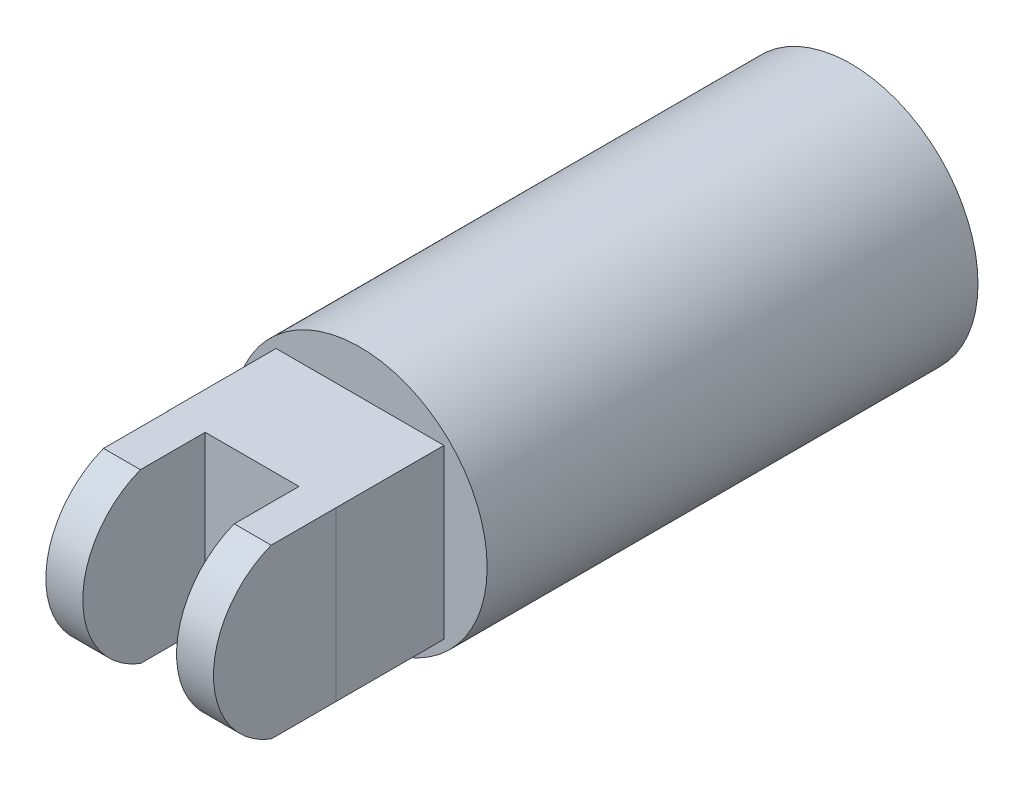
ISO-10303-21;
HEADER;
FILE_DESCRIPTION(('STEP AP214'),'2;1');
FILE_NAME('part.step','',(''),(''),'','','');
FILE_SCHEMA(('AUTOMOTIVE_DESIGN { 1 0 10303 214 1 1 1 1 }'));
ENDSEC;
DATA;
#1=APPLICATION_CONTEXT('core data for automotive mechanical design processes');
#2=APPLICATION_PROTOCOL_DEFINITION('international standard','automotive_design',2000,#1);
#3=PRODUCT_CONTEXT('',#1,'mechanical');
#4=PRODUCT('Part','Part','',(#3));
#5=PRODUCT_RELATED_PRODUCT_CATEGORY('part','',(#4));
#6=PRODUCT_DEFINITION_FORMATION('','',#4);
#7=PRODUCT_DEFINITION_CONTEXT('part definition',#1,'design');
#8=PRODUCT_DEFINITION('design','',#6,#7);
#9=PRODUCT_DEFINITION_SHAPE('','',#8);
#10=(LENGTH_UNIT() NAMED_UNIT(*) SI_UNIT(.MILLI.,.METRE.));
#11=(NAMED_UNIT(*) PLANE_ANGLE_UNIT() SI_UNIT($,.RADIAN.));
#12=(NAMED_UNIT(*) SI_UNIT($,.STERADIAN.) SOLID_ANGLE_UNIT());
#13=UNCERTAINTY_MEASURE_WITH_UNIT(LENGTH_MEASURE(1.E-05),#10,'distance_accuracy_value','');
#14=(GEOMETRIC_REPRESENTATION_CONTEXT(3) GLOBAL_UNCERTAINTY_ASSIGNED_CONTEXT((#13)) GLOBAL_UNIT_ASSIGNED_CONTEXT((#10,
#11,#12)) REPRESENTATION_CONTEXT('',''));
#15=CARTESIAN_POINT('',(0.,0.,0.));
#16=DIRECTION('',(0.,0.,1.));
#17=DIRECTION('',(1.,0.,0.));
#18=AXIS2_PLACEMENT_3D('',#15,#16,#17);
#19=CARTESIAN_POINT('',(0.,0.,30.5));
#20=DIRECTION('',(0.,0.,1.));
#21=DIRECTION('',(1.,0.,0.));
#22=AXIS2_PLACEMENT_3D('',#19,#20,#21);
#23=PLANE('',#22);
#24=DIRECTION('',(1.,0.,0.));
#25=VECTOR('',#24,1.);
#26=CARTESIAN_POINT('',(4.275,-4.275,30.5));
#27=LINE('',#26,#25);
#28=CARTESIAN_POINT('',(-2.38289149753268,-4.275,30.5));
#29=VERTEX_POINT('',#28);
#30=CARTESIAN_POINT('',(2.39501883876455,-4.275,30.5));
#31=VERTEX_POINT('',#30);
#32=EDGE_CURVE('E55',#29,#31,#27,.T.);
#33=ORIENTED_EDGE('',*,*,#32,.T.);
#34=DIRECTION('',(0.,-1.,0.));
#35=VECTOR('',#34,1.);
#36=CARTESIAN_POINT('',(2.39501883876455,-4.275,30.5));
#37=LINE('',#36,#35);
#38=CARTESIAN_POINT('',(2.39501883876455,4.275,30.5));
#39=VERTEX_POINT('',#38);
#40=EDGE_CURVE('E162',#39,#31,#37,.T.);
#41=ORIENTED_EDGE('',*,*,#40,.F.);
#42=DIRECTION('',(-1.,0.,0.));
#43=VECTOR('',#42,1.);
#44=CARTESIAN_POINT('',(4.275,4.275,30.5));
#45=LINE('',#44,#43);
#46=CARTESIAN_POINT('',(-2.38289149753268,4.275,30.5));
#47=VERTEX_POINT('',#46);
#48=EDGE_CURVE('E211',#39,#47,#45,.T.);
#49=ORIENTED_EDGE('',*,*,#48,.T.);
#50=DIRECTION('',(0.,1.,0.));
#51=VECTOR('',#50,1.);
#52=CARTESIAN_POINT('',(-2.38289149753268,-4.275,30.5));
#53=LINE('',#52,#51);
#54=EDGE_CURVE('E149',#29,#47,#53,.T.);
#55=ORIENTED_EDGE('',*,*,#54,.F.);
#56=EDGE_LOOP('',(#33,#41,#49,#55));
#57=FACE_BOUND('',#56,.T.);
#58=ADVANCED_FACE('F40',(#57),#23,.T.);
#59=DIRECTION('',(0.,-1.,0.));
#60=VECTOR('',#59,1.);
#61=CARTESIAN_POINT('',(-4.26289149753268,-4.275,30.5));
#62=LINE('',#61,#60);
#63=CARTESIAN_POINT('',(-4.26289149753268,4.275,30.5));
#64=VERTEX_POINT('',#63);
#65=CARTESIAN_POINT('',(-4.26289149753268,-4.275,30.5));
#66=VERTEX_POINT('',#65);
#67=EDGE_CURVE('E63',#64,#66,#62,.T.);
#68=ORIENTED_EDGE('',*,*,#67,.F.);
#69=CARTESIAN_POINT('',(-4.275,4.275,30.5));
#70=VERTEX_POINT('',#69);
#71=EDGE_CURVE('E210',#64,#70,#45,.T.);
#72=ORIENTED_EDGE('',*,*,#71,.T.);
#73=DIRECTION('',(0.,-1.,0.));
#74=VECTOR('',#73,1.);
#75=CARTESIAN_POINT('',(-4.275,-4.275,30.5));
#76=LINE('',#75,#74);
#77=CARTESIAN_POINT('',(-4.275,-4.275,30.5));
#78=VERTEX_POINT('',#77);
#79=EDGE_CURVE('E201',#70,#78,#76,.T.);
#80=ORIENTED_EDGE('',*,*,#79,.T.);
#81=EDGE_CURVE('E205',#78,#66,#27,.T.);
#82=ORIENTED_EDGE('',*,*,#81,.T.);
#83=EDGE_LOOP('',(#68,#72,#80,#82));
#84=FACE_BOUND('',#83,.T.);
#85=ADVANCED_FACE('F251',(#84),#23,.T.);
#86=CARTESIAN_POINT('',(0.,0.,25.));
#87=DIRECTION('',(0.,0.,-1.));
#88=DIRECTION('',(-1.,0.,0.));
#89=AXIS2_PLACEMENT_3D('',#86,#87,#88);
#90=CYLINDRICAL_SURFACE('',#89,6.475);
#91=CARTESIAN_POINT('',(0.,0.,25.));
#92=DIRECTION('',(0.,0.,1.));
#93=DIRECTION('',(1.,0.,0.));
#94=AXIS2_PLACEMENT_3D('',#91,#92,#93);
#95=CIRCLE('',#94,6.475);
#96=CARTESIAN_POINT('',(6.475,0.,25.));
#97=VERTEX_POINT('',#96);
#98=EDGE_CURVE('E11',#97,#97,#95,.T.);
#99=ORIENTED_EDGE('',*,*,#98,.F.);
#100=EDGE_LOOP('',(#99));
#101=FACE_BOUND('',#100,.T.);
#102=CARTESIAN_POINT('',(0.,0.,0.));
#103=DIRECTION('',(0.,0.,1.));
#104=DIRECTION('',(1.,0.,0.));
#105=AXIS2_PLACEMENT_3D('',#102,#103,#104);
#106=CIRCLE('',#105,6.475);
#107=CARTESIAN_POINT('',(6.475,0.,0.));
#108=VERTEX_POINT('',#107);
#109=EDGE_CURVE('E44',#108,#108,#106,.T.);
#110=ORIENTED_EDGE('',*,*,#109,.T.);
#111=EDGE_LOOP('',(#110));
#112=FACE_BOUND('',#111,.T.);
#113=ADVANCED_FACE('F42',(#101,#112),#90,.T.);
#114=CARTESIAN_POINT('',(0.,0.,25.));
#115=DIRECTION('',(0.,0.,1.));
#116=DIRECTION('',(1.,0.,0.));
#117=AXIS2_PLACEMENT_3D('',#114,#115,#116);
#118=PLANE('',#117);
#119=DIRECTION('',(0.,-1.,0.));
#120=VECTOR('',#119,1.);
#121=CARTESIAN_POINT('',(-4.275,-4.275,25.));
#122=LINE('',#121,#120);
#123=CARTESIAN_POINT('',(-4.275,4.275,25.));
#124=VERTEX_POINT('',#123);
#125=CARTESIAN_POINT('',(-4.275,-4.275,25.));
#126=VERTEX_POINT('',#125);
#127=EDGE_CURVE('E137',#124,#126,#122,.T.);
#128=ORIENTED_EDGE('',*,*,#127,.F.);
#129=DIRECTION('',(-1.,0.,0.));
#130=VECTOR('',#129,1.);
#131=CARTESIAN_POINT('',(4.275,4.275,25.));
#132=LINE('',#131,#130);
#133=CARTESIAN_POINT('',(4.275,4.275,25.));
#134=VERTEX_POINT('',#133);
#135=EDGE_CURVE('E204',#134,#124,#132,.T.);
#136=ORIENTED_EDGE('',*,*,#135,.F.);
#137=DIRECTION('',(0.,1.,0.));
#138=VECTOR('',#137,1.);
#139=CARTESIAN_POINT('',(4.275,-4.275,25.));
#140=LINE('',#139,#138);
#141=CARTESIAN_POINT('',(4.275,-4.275,25.));
#142=VERTEX_POINT('',#141);
#143=EDGE_CURVE('E218',#142,#134,#140,.T.);
#144=ORIENTED_EDGE('',*,*,#143,.F.);
#145=DIRECTION('',(1.,0.,0.));
#146=VECTOR('',#145,1.);
#147=CARTESIAN_POINT('',(4.275,-4.275,25.));
#148=LINE('',#147,#146);
#149=EDGE_CURVE('E216',#126,#142,#148,.T.);
#150=ORIENTED_EDGE('',*,*,#149,.F.);
#151=EDGE_LOOP('',(#128,#136,#144,#150));
#152=FACE_BOUND('',#151,.T.);
#153=ORIENTED_EDGE('',*,*,#98,.T.);
#154=EDGE_LOOP('',(#153));
#155=FACE_BOUND('',#154,.T.);
#156=ADVANCED_FACE('F241',(#152,#155),#118,.T.);
#157=CARTESIAN_POINT('',(0.,0.,0.));
#158=DIRECTION('',(0.,0.,1.));
#159=DIRECTION('',(1.,0.,0.));
#160=AXIS2_PLACEMENT_3D('',#157,#158,#159);
#161=PLANE('',#160);
#162=ORIENTED_EDGE('',*,*,#109,.F.);
#163=EDGE_LOOP('',(#162));
#164=FACE_BOUND('',#163,.T.);
#165=ADVANCED_FACE('F238',(#164),#161,.F.);
#166=CARTESIAN_POINT('',(-4.275,-4.275,30.5));
#167=DIRECTION('',(1.,0.,0.));
#168=DIRECTION('',(0.,0.,-1.));
#169=AXIS2_PLACEMENT_3D('',#166,#167,#168);
#170=PLANE('',#169);
#171=ORIENTED_EDGE('',*,*,#127,.T.);
#172=DIRECTION('',(0.,0.,-1.));
#173=VECTOR('',#172,1.);
#174=CARTESIAN_POINT('',(-4.275,-4.275,30.5));
#175=LINE('',#174,#173);
#176=EDGE_CURVE('E231',#78,#126,#175,.T.);
#177=ORIENTED_EDGE('',*,*,#176,.F.);
#178=ORIENTED_EDGE('',*,*,#79,.F.);
#179=DIRECTION('',(0.,0.,-1.));
#180=VECTOR('',#179,1.);
#181=CARTESIAN_POINT('',(-4.275,4.275,30.5));
#182=LINE('',#181,#180);
#183=EDGE_CURVE('E213',#70,#124,#182,.T.);
#184=ORIENTED_EDGE('',*,*,#183,.T.);
#185=EDGE_LOOP('',(#171,#177,#178,#184));
#186=FACE_BOUND('',#185,.T.);
#187=ADVANCED_FACE('F240',(#186),#170,.F.);
#188=CARTESIAN_POINT('',(4.275,-4.275,30.5));
#189=DIRECTION('',(0.,1.,0.));
#190=DIRECTION('',(-1.,0.,0.));
#191=AXIS2_PLACEMENT_3D('',#188,#189,#190);
#192=PLANE('',#191);
#193=ORIENTED_EDGE('',*,*,#149,.T.);
#194=DIRECTION('',(0.,0.,-1.));
#195=VECTOR('',#194,1.);
#196=CARTESIAN_POINT('',(4.275,-4.275,30.5));
#197=LINE('',#196,#195);
#198=CARTESIAN_POINT('',(4.275,-4.275,30.5));
#199=VERTEX_POINT('',#198);
#200=EDGE_CURVE('E228',#199,#142,#197,.T.);
#201=ORIENTED_EDGE('',*,*,#200,.F.);
#202=DIRECTION('',(1.,0.,0.));
#203=VECTOR('',#202,1.);
#204=CARTESIAN_POINT('',(4.27501883876455,-4.275,30.5));
#205=LINE('',#204,#203);
#206=CARTESIAN_POINT('',(4.27501883876455,-4.275,30.5));
#207=VERTEX_POINT('',#206);
#208=EDGE_CURVE('E175',#199,#207,#205,.T.);
#209=ORIENTED_EDGE('',*,*,#208,.T.);
#210=DIRECTION('',(0.,0.,-1.));
#211=VECTOR('',#210,1.);
#212=CARTESIAN_POINT('',(4.27501883876455,-4.275,33.8));
#213=LINE('',#212,#211);
#214=CARTESIAN_POINT('',(4.27501883876455,-4.275,33.8));
#215=VERTEX_POINT('',#214);
#216=EDGE_CURVE('E186',#215,#207,#213,.T.);
#217=ORIENTED_EDGE('',*,*,#216,.F.);
#218=DIRECTION('',(1.,0.,0.));
#219=VECTOR('',#218,1.);
#220=CARTESIAN_POINT('',(4.27501883876455,-4.275,33.8));
#221=LINE('',#220,#219);
#222=CARTESIAN_POINT('',(2.39501883876455,-4.275,33.8));
#223=VERTEX_POINT('',#222);
#224=EDGE_CURVE('E165',#223,#215,#221,.T.);
#225=ORIENTED_EDGE('',*,*,#224,.F.);
#226=DIRECTION('',(0.,0.,-1.));
#227=VECTOR('',#226,1.);
#228=CARTESIAN_POINT('',(2.39501883876455,-4.275,33.8));
#229=LINE('',#228,#227);
#230=EDGE_CURVE('E189',#223,#31,#229,.T.);
#231=ORIENTED_EDGE('',*,*,#230,.T.);
#232=ORIENTED_EDGE('',*,*,#32,.F.);
#233=DIRECTION('',(0.,0.,-1.));
#234=VECTOR('',#233,1.);
#235=CARTESIAN_POINT('',(-2.38289149753268,-4.275,33.8));
#236=LINE('',#235,#234);
#237=CARTESIAN_POINT('',(-2.38289149753268,-4.275,33.8));
#238=VERTEX_POINT('',#237);
#239=EDGE_CURVE('E138',#238,#29,#236,.T.);
#240=ORIENTED_EDGE('',*,*,#239,.F.);
#241=DIRECTION('',(1.,0.,0.));
#242=VECTOR('',#241,1.);
#243=CARTESIAN_POINT('',(-2.38289149753268,-4.275,33.8));
#244=LINE('',#243,#242);
#245=CARTESIAN_POINT('',(-4.26289149753268,-4.275,33.8));
#246=VERTEX_POINT('',#245);
#247=EDGE_CURVE('E141',#246,#238,#244,.T.);
#248=ORIENTED_EDGE('',*,*,#247,.F.);
#249=DIRECTION('',(0.,0.,-1.));
#250=VECTOR('',#249,1.);
#251=CARTESIAN_POINT('',(-4.26289149753268,-4.275,33.8));
#252=LINE('',#251,#250);
#253=EDGE_CURVE('E130',#246,#66,#252,.T.);
#254=ORIENTED_EDGE('',*,*,#253,.T.);
#255=ORIENTED_EDGE('',*,*,#81,.F.);
#256=ORIENTED_EDGE('',*,*,#176,.T.);
#257=EDGE_LOOP('',(#193,#201,#209,#217,#225,#231,#232,#240,#248,#254,#255,#256));
#258=FACE_BOUND('',#257,.T.);
#259=ADVANCED_FACE('F143',(#258),#192,.F.);
#260=CARTESIAN_POINT('',(4.275,-4.275,30.5));
#261=DIRECTION('',(-1.,0.,0.));
#262=DIRECTION('',(0.,0.,1.));
#263=AXIS2_PLACEMENT_3D('',#260,#261,#262);
#264=PLANE('',#263);
#265=ORIENTED_EDGE('',*,*,#143,.T.);
#266=DIRECTION('',(0.,0.,-1.));
#267=VECTOR('',#266,1.);
#268=CARTESIAN_POINT('',(4.275,4.275,30.5));
#269=LINE('',#268,#267);
#270=CARTESIAN_POINT('',(4.275,4.275,30.5));
#271=VERTEX_POINT('',#270);
#272=EDGE_CURVE('E225',#271,#134,#269,.T.);
#273=ORIENTED_EDGE('',*,*,#272,.F.);
#274=DIRECTION('',(0.,1.,0.));
#275=VECTOR('',#274,1.);
#276=CARTESIAN_POINT('',(4.275,-4.275,30.5));
#277=LINE('',#276,#275);
#278=EDGE_CURVE('E207',#199,#271,#277,.T.);
#279=ORIENTED_EDGE('',*,*,#278,.F.);
#280=ORIENTED_EDGE('',*,*,#200,.T.);
#281=EDGE_LOOP('',(#265,#273,#279,#280));
#282=FACE_BOUND('',#281,.T.);
#283=ADVANCED_FACE('F262',(#282),#264,.F.);
#284=CARTESIAN_POINT('',(4.275,4.275,30.5));
#285=DIRECTION('',(0.,-1.,0.));
#286=DIRECTION('',(1.,0.,0.));
#287=AXIS2_PLACEMENT_3D('',#284,#285,#286);
#288=PLANE('',#287);
#289=ORIENTED_EDGE('',*,*,#135,.T.);
#290=ORIENTED_EDGE('',*,*,#183,.F.);
#291=ORIENTED_EDGE('',*,*,#71,.F.);
#292=DIRECTION('',(0.,0.,-1.));
#293=VECTOR('',#292,1.);
#294=CARTESIAN_POINT('',(-4.26289149753268,4.275,33.8));
#295=LINE('',#294,#293);
#296=CARTESIAN_POINT('',(-4.26289149753268,4.275,33.8));
#297=VERTEX_POINT('',#296);
#298=EDGE_CURVE('E192',#297,#64,#295,.T.);
#299=ORIENTED_EDGE('',*,*,#298,.F.);
#300=DIRECTION('',(-1.,0.,0.));
#301=VECTOR('',#300,1.);
#302=CARTESIAN_POINT('',(-2.38289149753268,4.275,33.8));
#303=LINE('',#302,#301);
#304=CARTESIAN_POINT('',(-2.38289149753268,4.275,33.8));
#305=VERTEX_POINT('',#304);
#306=EDGE_CURVE('E148',#305,#297,#303,.T.);
#307=ORIENTED_EDGE('',*,*,#306,.F.);
#308=DIRECTION('',(0.,0.,-1.));
#309=VECTOR('',#308,1.);
#310=CARTESIAN_POINT('',(-2.38289149753268,4.275,33.8));
#311=LINE('',#310,#309);
#312=EDGE_CURVE('E197',#305,#47,#311,.T.);
#313=ORIENTED_EDGE('',*,*,#312,.T.);
#314=ORIENTED_EDGE('',*,*,#48,.F.);
#315=DIRECTION('',(0.,0.,-1.));
#316=VECTOR('',#315,1.);
#317=CARTESIAN_POINT('',(2.39501883876455,4.275,33.8));
#318=LINE('',#317,#316);
#319=CARTESIAN_POINT('',(2.39501883876455,4.275,33.8));
#320=VERTEX_POINT('',#319);
#321=EDGE_CURVE('E172',#320,#39,#318,.T.);
#322=ORIENTED_EDGE('',*,*,#321,.F.);
#323=DIRECTION('',(-1.,0.,0.));
#324=VECTOR('',#323,1.);
#325=CARTESIAN_POINT('',(4.27501883876455,4.275,33.8));
#326=LINE('',#325,#324);
#327=CARTESIAN_POINT('',(4.27501883876455,4.275,33.8));
#328=VERTEX_POINT('',#327);
#329=EDGE_CURVE('E168',#328,#320,#326,.T.);
#330=ORIENTED_EDGE('',*,*,#329,.F.);
#331=DIRECTION('',(0.,0.,-1.));
#332=VECTOR('',#331,1.);
#333=CARTESIAN_POINT('',(4.27501883876455,4.275,33.8));
#334=LINE('',#333,#332);
#335=CARTESIAN_POINT('',(4.27501883876455,4.275,30.5));
#336=VERTEX_POINT('',#335);
#337=EDGE_CURVE('E183',#328,#336,#334,.T.);
#338=ORIENTED_EDGE('',*,*,#337,.T.);
#339=DIRECTION('',(-1.,0.,0.));
#340=VECTOR('',#339,1.);
#341=CARTESIAN_POINT('',(4.27501883876455,4.275,30.5));
#342=LINE('',#341,#340);
#343=EDGE_CURVE('E169',#336,#271,#342,.T.);
#344=ORIENTED_EDGE('',*,*,#343,.T.);
#345=ORIENTED_EDGE('',*,*,#272,.T.);
#346=EDGE_LOOP('',(#289,#290,#291,#299,#307,#313,#314,#322,#330,#338,#344,#345));
#347=FACE_BOUND('',#346,.T.);
#348=ADVANCED_FACE('F259',(#347),#288,.F.);
#349=CARTESIAN_POINT('',(-4.26289149753268,-4.275,33.8));
#350=DIRECTION('',(1.,0.,0.));
#351=DIRECTION('',(0.,0.,-1.));
#352=AXIS2_PLACEMENT_3D('',#349,#350,#351);
#353=PLANE('',#352);
#354=ORIENTED_EDGE('',*,*,#67,.T.);
#355=ORIENTED_EDGE('',*,*,#253,.F.);
#356=CARTESIAN_POINT('',(-4.26289149753268,0.,32.1565965194146));
#357=DIRECTION('',(-1.,0.,0.));
#358=DIRECTION('',(0.,0.,-1.));
#359=AXIS2_PLACEMENT_3D('',#356,#357,#358);
#360=CIRCLE('',#359,4.58000000000001);
#361=EDGE_CURVE('E135',#246,#297,#360,.T.);
#362=ORIENTED_EDGE('',*,*,#361,.T.);
#363=ORIENTED_EDGE('',*,*,#298,.T.);
#364=EDGE_LOOP('',(#354,#355,#362,#363));
#365=FACE_BOUND('',#364,.T.);
#366=ADVANCED_FACE('F132',(#365),#353,.F.);
#367=CARTESIAN_POINT('',(-2.38289149753268,-4.275,33.8));
#368=DIRECTION('',(-1.,0.,0.));
#369=DIRECTION('',(0.,0.,1.));
#370=AXIS2_PLACEMENT_3D('',#367,#368,#369);
#371=PLANE('',#370);
#372=ORIENTED_EDGE('',*,*,#54,.T.);
#373=ORIENTED_EDGE('',*,*,#312,.F.);
#374=CARTESIAN_POINT('',(-2.38289149753268,0.,32.1565965194146));
#375=DIRECTION('',(-1.,0.,0.));
#376=DIRECTION('',(0.,0.,-1.));
#377=AXIS2_PLACEMENT_3D('',#374,#375,#376);
#378=CIRCLE('',#377,4.58000000000001);
#379=EDGE_CURVE('E154',#238,#305,#378,.T.);
#380=ORIENTED_EDGE('',*,*,#379,.F.);
#381=ORIENTED_EDGE('',*,*,#239,.T.);
#382=EDGE_LOOP('',(#372,#373,#380,#381));
#383=FACE_BOUND('',#382,.T.);
#384=ADVANCED_FACE('F288',(#383),#371,.F.);
#385=CARTESIAN_POINT('',(0.,0.,30.5));
#386=DIRECTION('',(0.,0.,1.));
#387=DIRECTION('',(1.,0.,0.));
#388=AXIS2_PLACEMENT_3D('',#385,#386,#387);
#389=PLANE('',#388);
#390=ORIENTED_EDGE('',*,*,#208,.F.);
#391=ORIENTED_EDGE('',*,*,#278,.T.);
#392=ORIENTED_EDGE('',*,*,#343,.F.);
#393=DIRECTION('',(0.,1.,0.));
#394=VECTOR('',#393,1.);
#395=CARTESIAN_POINT('',(4.27501883876455,-4.275,30.5));
#396=LINE('',#395,#394);
#397=EDGE_CURVE('E177',#207,#336,#396,.T.);
#398=ORIENTED_EDGE('',*,*,#397,.F.);
#399=EDGE_LOOP('',(#390,#391,#392,#398));
#400=FACE_BOUND('',#399,.T.);
#401=ADVANCED_FACE('F294',(#400),#389,.F.);
#402=CARTESIAN_POINT('',(2.39501883876455,-4.275,33.8));
#403=DIRECTION('',(1.,0.,0.));
#404=DIRECTION('',(0.,0.,-1.));
#405=AXIS2_PLACEMENT_3D('',#402,#403,#404);
#406=PLANE('',#405);
#407=ORIENTED_EDGE('',*,*,#40,.T.);
#408=ORIENTED_EDGE('',*,*,#230,.F.);
#409=CARTESIAN_POINT('',(2.39501883876455,0.,32.1565965194147));
#410=DIRECTION('',(1.,0.,0.));
#411=DIRECTION('',(0.,0.,-1.));
#412=AXIS2_PLACEMENT_3D('',#409,#410,#411);
#413=CIRCLE('',#412,4.58);
#414=EDGE_CURVE('E159',#320,#223,#413,.T.);
#415=ORIENTED_EDGE('',*,*,#414,.F.);
#416=ORIENTED_EDGE('',*,*,#321,.T.);
#417=EDGE_LOOP('',(#407,#408,#415,#416));
#418=FACE_BOUND('',#417,.T.);
#419=ADVANCED_FACE('F301',(#418),#406,.F.);
#420=CARTESIAN_POINT('',(4.27501883876455,-4.275,33.8));
#421=DIRECTION('',(-1.,0.,0.));
#422=DIRECTION('',(0.,0.,1.));
#423=AXIS2_PLACEMENT_3D('',#420,#421,#422);
#424=PLANE('',#423);
#425=ORIENTED_EDGE('',*,*,#397,.T.);
#426=ORIENTED_EDGE('',*,*,#337,.F.);
#427=CARTESIAN_POINT('',(4.27501883876455,0.,32.1565965194147));
#428=DIRECTION('',(1.,0.,0.));
#429=DIRECTION('',(0.,0.,-1.));
#430=AXIS2_PLACEMENT_3D('',#427,#428,#429);
#431=CIRCLE('',#430,4.58);
#432=EDGE_CURVE('E156',#328,#215,#431,.T.);
#433=ORIENTED_EDGE('',*,*,#432,.T.);
#434=ORIENTED_EDGE('',*,*,#216,.T.);
#435=EDGE_LOOP('',(#425,#426,#433,#434));
#436=FACE_BOUND('',#435,.T.);
#437=ADVANCED_FACE('F309',(#436),#424,.F.);
#438=CARTESIAN_POINT('',(2.39501883876455,0.,32.1565965194147));
#439=DIRECTION('',(1.,0.,0.));
#440=DIRECTION('',(0.,0.,-1.));
#441=AXIS2_PLACEMENT_3D('',#438,#439,#440);
#442=CYLINDRICAL_SURFACE('',#441,4.58);
#443=ORIENTED_EDGE('',*,*,#432,.F.);
#444=ORIENTED_EDGE('',*,*,#329,.T.);
#445=ORIENTED_EDGE('',*,*,#414,.T.);
#446=ORIENTED_EDGE('',*,*,#224,.T.);
#447=EDGE_LOOP('',(#443,#444,#445,#446));
#448=FACE_BOUND('',#447,.T.);
#449=ADVANCED_FACE('F317',(#448),#442,.T.);
#450=CARTESIAN_POINT('',(-2.38289149753268,0.,32.1565965194146));
#451=DIRECTION('',(-1.,0.,0.));
#452=DIRECTION('',(0.,0.,1.));
#453=AXIS2_PLACEMENT_3D('',#450,#451,#452);
#454=CYLINDRICAL_SURFACE('',#453,4.58000000000001);
#455=ORIENTED_EDGE('',*,*,#361,.F.);
#456=ORIENTED_EDGE('',*,*,#247,.T.);
#457=ORIENTED_EDGE('',*,*,#379,.T.);
#458=ORIENTED_EDGE('',*,*,#306,.T.);
#459=EDGE_LOOP('',(#455,#456,#457,#458));
#460=FACE_BOUND('',#459,.T.);
#461=ADVANCED_FACE('F152',(#460),#454,.T.);
#462=CLOSED_SHELL('',(#58,#85,#113,#156,#165,#187,#259,#283,#348,#366,#384,#401,#419,#437,#449,#461));
#463=MANIFOLD_SOLID_BREP('B2',#462);
#464=ADVANCED_BREP_SHAPE_REPRESENTATION('',(#18,#463),#14);
#465=SHAPE_DEFINITION_REPRESENTATION(#9,#464);
ENDSEC;
END-ISO-10303-21;
